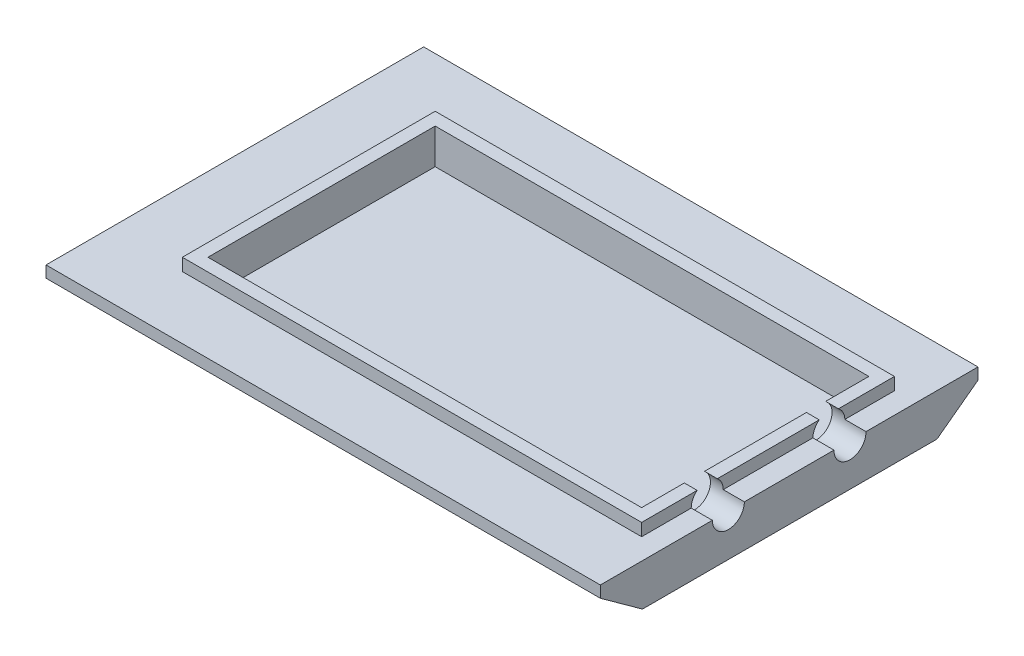
ISO-10303-21;
HEADER;
FILE_DESCRIPTION(('STEP AP214'),'2;1');
FILE_NAME('part.step','',(''),(''),'','','');
FILE_SCHEMA(('AUTOMOTIVE_DESIGN { 1 0 10303 214 1 1 1 1 }'));
ENDSEC;
DATA;
#1=APPLICATION_CONTEXT('core data for automotive mechanical design processes');
#2=APPLICATION_PROTOCOL_DEFINITION('international standard','automotive_design',2000,#1);
#3=PRODUCT_CONTEXT('',#1,'mechanical');
#4=PRODUCT('Part','Part','',(#3));
#5=PRODUCT_RELATED_PRODUCT_CATEGORY('part','',(#4));
#6=PRODUCT_DEFINITION_FORMATION('','',#4);
#7=PRODUCT_DEFINITION_CONTEXT('part definition',#1,'design');
#8=PRODUCT_DEFINITION('design','',#6,#7);
#9=PRODUCT_DEFINITION_SHAPE('','',#8);
#10=(LENGTH_UNIT() NAMED_UNIT(*) SI_UNIT(.MILLI.,.METRE.));
#11=(NAMED_UNIT(*) PLANE_ANGLE_UNIT() SI_UNIT($,.RADIAN.));
#12=(NAMED_UNIT(*) SI_UNIT($,.STERADIAN.) SOLID_ANGLE_UNIT());
#13=UNCERTAINTY_MEASURE_WITH_UNIT(LENGTH_MEASURE(1.E-05),#10,'distance_accuracy_value','');
#14=(GEOMETRIC_REPRESENTATION_CONTEXT(3) GLOBAL_UNCERTAINTY_ASSIGNED_CONTEXT((#13)) GLOBAL_UNIT_ASSIGNED_CONTEXT((#10,
#11,#12)) REPRESENTATION_CONTEXT('',''));
#15=CARTESIAN_POINT('',(0.,0.,0.));
#16=DIRECTION('',(0.,0.,1.));
#17=DIRECTION('',(1.,0.,0.));
#18=AXIS2_PLACEMENT_3D('',#15,#16,#17);
#19=CARTESIAN_POINT('',(0.,21.59,0.));
#20=DIRECTION('',(0.,1.,0.));
#21=DIRECTION('',(0.,0.,1.));
#22=AXIS2_PLACEMENT_3D('',#19,#20,#21);
#23=PLANE('',#22);
#24=DIRECTION('',(1.,0.,0.));
#25=VECTOR('',#24,1.);
#26=CARTESIAN_POINT('',(-19.05,21.59,86.7760235248049));
#27=LINE('',#26,#25);
#28=CARTESIAN_POINT('',(-13.462,21.59,86.7760235248049));
#29=VERTEX_POINT('',#28);
#30=CARTESIAN_POINT('',(-8.382,21.59,86.7760235248049));
#31=VERTEX_POINT('',#30);
#32=EDGE_CURVE('E480',#29,#31,#27,.T.);
#33=ORIENTED_EDGE('',*,*,#32,.F.);
#34=DIRECTION('',(0.,0.,-1.));
#35=VECTOR('',#34,1.);
#36=CARTESIAN_POINT('',(-13.462,21.59,13.5558695652174));
#37=LINE('',#36,#35);
#38=CARTESIAN_POINT('',(-13.462,21.59,103.725869565217));
#39=VERTEX_POINT('',#38);
#40=EDGE_CURVE('E483',#39,#29,#37,.T.);
#41=ORIENTED_EDGE('',*,*,#40,.F.);
#42=DIRECTION('',(1.,0.,0.));
#43=VECTOR('',#42,1.);
#44=CARTESIAN_POINT('',(-185.547,21.59,103.725869565217));
#45=LINE('',#44,#43);
#46=CARTESIAN_POINT('',(-185.547,21.59,103.725869565217));
#47=VERTEX_POINT('',#46);
#48=EDGE_CURVE('E505',#47,#39,#45,.T.);
#49=ORIENTED_EDGE('',*,*,#48,.F.);
#50=DIRECTION('',(0.,0.,1.));
#51=VECTOR('',#50,1.);
#52=CARTESIAN_POINT('',(-185.547,21.59,13.5558695652174));
#53=LINE('',#52,#51);
#54=CARTESIAN_POINT('',(-185.547,21.59,13.5558695652174));
#55=VERTEX_POINT('',#54);
#56=EDGE_CURVE('E509',#55,#47,#53,.T.);
#57=ORIENTED_EDGE('',*,*,#56,.F.);
#58=DIRECTION('',(-1.,0.,0.));
#59=VECTOR('',#58,1.);
#60=CARTESIAN_POINT('',(-185.547,21.59,13.5558695652174));
#61=LINE('',#60,#59);
#62=CARTESIAN_POINT('',(-13.462,21.59,13.5558695652174));
#63=VERTEX_POINT('',#62);
#64=EDGE_CURVE('E512',#63,#55,#61,.T.);
#65=ORIENTED_EDGE('',*,*,#64,.F.);
#66=CARTESIAN_POINT('',(-13.462,21.59,30.7008695652174));
#67=VERTEX_POINT('',#66);
#68=EDGE_CURVE('E499',#67,#63,#37,.T.);
#69=ORIENTED_EDGE('',*,*,#68,.F.);
#70=DIRECTION('',(1.,0.,0.));
#71=VECTOR('',#70,1.);
#72=CARTESIAN_POINT('',(-19.05,21.59,30.7008695652174));
#73=LINE('',#72,#71);
#74=CARTESIAN_POINT('',(-8.382,21.59,30.7008695652174));
#75=VERTEX_POINT('',#74);
#76=EDGE_CURVE('E70',#75,#67,#73,.F.);
#77=ORIENTED_EDGE('',*,*,#76,.F.);
#78=DIRECTION('',(0.,0.,-1.));
#79=VECTOR('',#78,1.);
#80=CARTESIAN_POINT('',(-8.382,21.59,8.47586956521745));
#81=LINE('',#80,#79);
#82=CARTESIAN_POINT('',(-8.382,21.59,8.47586956521745));
#83=VERTEX_POINT('',#82);
#84=EDGE_CURVE('E585',#75,#83,#81,.T.);
#85=ORIENTED_EDGE('',*,*,#84,.T.);
#86=DIRECTION('',(-1.,0.,0.));
#87=VECTOR('',#86,1.);
#88=CARTESIAN_POINT('',(-190.627,21.59,8.47586956521744));
#89=LINE('',#88,#87);
#90=CARTESIAN_POINT('',(-190.627,21.59,8.47586956521744));
#91=VERTEX_POINT('',#90);
#92=EDGE_CURVE('E589',#83,#91,#89,.T.);
#93=ORIENTED_EDGE('',*,*,#92,.T.);
#94=DIRECTION('',(0.,0.,1.));
#95=VECTOR('',#94,1.);
#96=CARTESIAN_POINT('',(-190.627,21.59,8.47586956521744));
#97=LINE('',#96,#95);
#98=CARTESIAN_POINT('',(-190.627,21.59,108.805869565217));
#99=VERTEX_POINT('',#98);
#100=EDGE_CURVE('E681',#91,#99,#97,.T.);
#101=ORIENTED_EDGE('',*,*,#100,.T.);
#102=DIRECTION('',(1.,0.,0.));
#103=VECTOR('',#102,1.);
#104=CARTESIAN_POINT('',(-190.627,21.59,108.805869565217));
#105=LINE('',#104,#103);
#106=CARTESIAN_POINT('',(-8.382,21.59,108.805869565217));
#107=VERTEX_POINT('',#106);
#108=EDGE_CURVE('E590',#99,#107,#105,.T.);
#109=ORIENTED_EDGE('',*,*,#108,.T.);
#110=EDGE_CURVE('E485',#107,#31,#81,.T.);
#111=ORIENTED_EDGE('',*,*,#110,.T.);
#112=EDGE_LOOP('',(#33,#41,#49,#57,#65,#69,#77,#85,#93,#101,#109,#111));
#113=FACE_BOUND('',#112,.T.);
#114=ADVANCED_FACE('F53',(#113),#23,.T.);
#115=CARTESIAN_POINT('',(0.,16.6624,0.));
#116=DIRECTION('',(0.,1.,0.));
#117=DIRECTION('',(0.,0.,1.));
#118=AXIS2_PLACEMENT_3D('',#115,#116,#117);
#119=PLANE('',#118);
#120=DIRECTION('',(1.,0.,0.));
#121=VECTOR('',#120,1.);
#122=CARTESIAN_POINT('',(-19.05,16.6624,89.1208695652174));
#123=LINE('',#122,#121);
#124=CARTESIAN_POINT('',(-8.382,16.6624,89.1208695652174));
#125=VERTEX_POINT('',#124);
#126=CARTESIAN_POINT('',(0.,16.6624,89.1208695652174));
#127=VERTEX_POINT('',#126);
#128=EDGE_CURVE('E533',#125,#127,#123,.T.);
#129=ORIENTED_EDGE('',*,*,#128,.F.);
#130=DIRECTION('',(0.,0.,1.));
#131=VECTOR('',#130,1.);
#132=CARTESIAN_POINT('',(-8.382,16.6624,0.));
#133=LINE('',#132,#131);
#134=CARTESIAN_POINT('',(-8.382,16.6624,108.805869565217));
#135=VERTEX_POINT('',#134);
#136=EDGE_CURVE('E564',#125,#135,#133,.T.);
#137=ORIENTED_EDGE('',*,*,#136,.T.);
#138=DIRECTION('',(-1.,0.,0.));
#139=VECTOR('',#138,1.);
#140=CARTESIAN_POINT('',(0.,16.6624,108.805869565217));
#141=LINE('',#140,#139);
#142=CARTESIAN_POINT('',(-190.627,16.6624,108.805869565217));
#143=VERTEX_POINT('',#142);
#144=EDGE_CURVE('E568',#135,#143,#141,.T.);
#145=ORIENTED_EDGE('',*,*,#144,.T.);
#146=DIRECTION('',(0.,0.,-1.));
#147=VECTOR('',#146,1.);
#148=CARTESIAN_POINT('',(-190.627,16.6624,0.));
#149=LINE('',#148,#147);
#150=CARTESIAN_POINT('',(-190.627,16.6624,8.47586956521744));
#151=VERTEX_POINT('',#150);
#152=EDGE_CURVE('E576',#143,#151,#149,.T.);
#153=ORIENTED_EDGE('',*,*,#152,.T.);
#154=DIRECTION('',(1.,0.,0.));
#155=VECTOR('',#154,1.);
#156=CARTESIAN_POINT('',(0.,16.6624,8.47586956521745));
#157=LINE('',#156,#155);
#158=CARTESIAN_POINT('',(-8.382,16.6624,8.47586956521745));
#159=VERTEX_POINT('',#158);
#160=EDGE_CURVE('E569',#151,#159,#157,.T.);
#161=ORIENTED_EDGE('',*,*,#160,.T.);
#162=CARTESIAN_POINT('',(-8.382,16.6624,28.1626986286405));
#163=VERTEX_POINT('',#162);
#164=EDGE_CURVE('E223',#159,#163,#133,.T.);
#165=ORIENTED_EDGE('',*,*,#164,.T.);
#166=DIRECTION('',(1.,0.,0.));
#167=VECTOR('',#166,1.);
#168=CARTESIAN_POINT('',(-19.05,16.6624,28.1626986286405));
#169=LINE('',#168,#167);
#170=CARTESIAN_POINT('',(0.,16.6624,28.1626986286405));
#171=VERTEX_POINT('',#170);
#172=EDGE_CURVE('E204',#171,#163,#169,.F.);
#173=ORIENTED_EDGE('',*,*,#172,.F.);
#174=DIRECTION('',(0.,0.,-1.));
#175=VECTOR('',#174,1.);
#176=CARTESIAN_POINT('',(0.,16.6624,-16.2891304347826));
#177=LINE('',#176,#175);
#178=CARTESIAN_POINT('',(0.,16.6624,-16.2891304347826));
#179=VERTEX_POINT('',#178);
#180=EDGE_CURVE('E219',#171,#179,#177,.T.);
#181=ORIENTED_EDGE('',*,*,#180,.T.);
#182=DIRECTION('',(-1.,0.,0.));
#183=VECTOR('',#182,1.);
#184=CARTESIAN_POINT('',(-219.964,16.6624,-16.2891304347826));
#185=LINE('',#184,#183);
#186=CARTESIAN_POINT('',(-219.964,16.6624,-16.2891304347826));
#187=VERTEX_POINT('',#186);
#188=EDGE_CURVE('E243',#179,#187,#185,.T.);
#189=ORIENTED_EDGE('',*,*,#188,.T.);
#190=DIRECTION('',(0.,0.,1.));
#191=VECTOR('',#190,1.);
#192=CARTESIAN_POINT('',(-219.964,16.6624,-16.2891304347826));
#193=LINE('',#192,#191);
#194=CARTESIAN_POINT('',(-219.964,16.6624,133.570869565217));
#195=VERTEX_POINT('',#194);
#196=EDGE_CURVE('E238',#187,#195,#193,.T.);
#197=ORIENTED_EDGE('',*,*,#196,.T.);
#198=DIRECTION('',(1.,0.,0.));
#199=VECTOR('',#198,1.);
#200=CARTESIAN_POINT('',(-219.964,16.6624,133.570869565217));
#201=LINE('',#200,#199);
#202=CARTESIAN_POINT('',(0.,16.6624,133.570869565217));
#203=VERTEX_POINT('',#202);
#204=EDGE_CURVE('E233',#195,#203,#201,.T.);
#205=ORIENTED_EDGE('',*,*,#204,.T.);
#206=EDGE_CURVE('E235',#203,#127,#177,.T.);
#207=ORIENTED_EDGE('',*,*,#206,.T.);
#208=EDGE_LOOP('',(#129,#137,#145,#153,#161,#165,#173,#181,#189,#197,#205,#207));
#209=FACE_BOUND('',#208,.T.);
#210=ADVANCED_FACE('F218',(#209),#119,.T.);
#211=CARTESIAN_POINT('',(-8.382,21.59,8.47586956521745));
#212=DIRECTION('',(-1.,0.,0.));
#213=DIRECTION('',(0.,0.,1.));
#214=AXIS2_PLACEMENT_3D('',#211,#212,#213);
#215=PLANE('',#214);
#216=ORIENTED_EDGE('',*,*,#136,.F.);
#217=CARTESIAN_POINT('',(-8.382,16.6624,82.7708695652174));
#218=DIRECTION('',(-1.,0.,0.));
#219=DIRECTION('',(0.,0.,1.));
#220=AXIS2_PLACEMENT_3D('',#217,#218,#219);
#221=CIRCLE('',#220,6.35);
#222=EDGE_CURVE('E539',#125,#31,#221,.T.);
#223=ORIENTED_EDGE('',*,*,#222,.T.);
#224=ORIENTED_EDGE('',*,*,#110,.F.);
#225=DIRECTION('',(0.,-1.,0.));
#226=VECTOR('',#225,1.);
#227=CARTESIAN_POINT('',(-8.382,21.59,108.805869565217));
#228=LINE('',#227,#226);
#229=EDGE_CURVE('E603',#107,#135,#228,.T.);
#230=ORIENTED_EDGE('',*,*,#229,.T.);
#231=EDGE_LOOP('',(#216,#223,#224,#230));
#232=FACE_BOUND('',#231,.T.);
#233=ADVANCED_FACE('F438',(#232),#215,.F.);
#234=CARTESIAN_POINT('',(-8.382,21.59,78.7657156056298));
#235=VERTEX_POINT('',#234);
#236=CARTESIAN_POINT('',(-8.382,21.59,38.3208695652174));
#237=VERTEX_POINT('',#236);
#238=EDGE_CURVE('E583',#235,#237,#81,.T.);
#239=ORIENTED_EDGE('',*,*,#238,.F.);
#240=CARTESIAN_POINT('',(-8.382,16.6624,76.4208695652174));
#241=VERTEX_POINT('',#240);
#242=EDGE_CURVE('E488',#235,#241,#221,.T.);
#243=ORIENTED_EDGE('',*,*,#242,.T.);
#244=CARTESIAN_POINT('',(-8.382,16.6624,40.8590405017944));
#245=VERTEX_POINT('',#244);
#246=EDGE_CURVE('E560',#245,#241,#133,.T.);
#247=ORIENTED_EDGE('',*,*,#246,.F.);
#248=CARTESIAN_POINT('',(-8.382,16.51,34.5108695652174));
#249=DIRECTION('',(-1.,0.,0.));
#250=DIRECTION('',(0.,0.,1.));
#251=AXIS2_PLACEMENT_3D('',#248,#249,#250);
#252=CIRCLE('',#251,6.35);
#253=EDGE_CURVE('E225',#245,#237,#252,.T.);
#254=ORIENTED_EDGE('',*,*,#253,.T.);
#255=EDGE_LOOP('',(#239,#243,#247,#254));
#256=FACE_BOUND('',#255,.T.);
#257=ADVANCED_FACE('F439',(#256),#215,.F.);
#258=DIRECTION('',(1.,0.,0.));
#259=VECTOR('',#258,1.);
#260=CARTESIAN_POINT('',(-19.05,21.59,78.7657156056298));
#261=LINE('',#260,#259);
#262=CARTESIAN_POINT('',(-13.462,21.59,78.7657156056298));
#263=VERTEX_POINT('',#262);
#264=EDGE_CURVE('E77',#235,#263,#261,.F.);
#265=ORIENTED_EDGE('',*,*,#264,.F.);
#266=ORIENTED_EDGE('',*,*,#238,.T.);
#267=DIRECTION('',(1.,0.,0.));
#268=VECTOR('',#267,1.);
#269=CARTESIAN_POINT('',(-19.05,21.59,38.3208695652174));
#270=LINE('',#269,#268);
#271=CARTESIAN_POINT('',(-13.462,21.59,38.3208695652174));
#272=VERTEX_POINT('',#271);
#273=EDGE_CURVE('E550',#272,#237,#270,.T.);
#274=ORIENTED_EDGE('',*,*,#273,.F.);
#275=EDGE_CURVE('E497',#263,#272,#37,.T.);
#276=ORIENTED_EDGE('',*,*,#275,.F.);
#277=EDGE_LOOP('',(#265,#266,#274,#276));
#278=FACE_BOUND('',#277,.T.);
#279=ADVANCED_FACE('F424',(#278),#23,.T.);
#280=DIRECTION('',(1.,0.,0.));
#281=VECTOR('',#280,1.);
#282=CARTESIAN_POINT('',(-19.05,16.6624,76.4208695652174));
#283=LINE('',#282,#281);
#284=CARTESIAN_POINT('',(0.,16.6624,76.4208695652174));
#285=VERTEX_POINT('',#284);
#286=EDGE_CURVE('E536',#285,#241,#283,.F.);
#287=ORIENTED_EDGE('',*,*,#286,.F.);
#288=CARTESIAN_POINT('',(0.,16.6624,40.8590405017944));
#289=VERTEX_POINT('',#288);
#290=EDGE_CURVE('E232',#285,#289,#177,.T.);
#291=ORIENTED_EDGE('',*,*,#290,.T.);
#292=DIRECTION('',(1.,0.,0.));
#293=VECTOR('',#292,1.);
#294=CARTESIAN_POINT('',(-19.05,16.6624,40.8590405017944));
#295=LINE('',#294,#293);
#296=EDGE_CURVE('E207',#245,#289,#295,.T.);
#297=ORIENTED_EDGE('',*,*,#296,.F.);
#298=ORIENTED_EDGE('',*,*,#246,.T.);
#299=EDGE_LOOP('',(#287,#291,#297,#298));
#300=FACE_BOUND('',#299,.T.);
#301=ADVANCED_FACE('F421',(#300),#119,.T.);
#302=CARTESIAN_POINT('',(0.,0.,0.));
#303=DIRECTION('',(0.,1.,0.));
#304=DIRECTION('',(0.,0.,1.));
#305=AXIS2_PLACEMENT_3D('',#302,#303,#304);
#306=PLANE('',#305);
#307=DIRECTION('',(0.,0.,1.));
#308=VECTOR('',#307,1.);
#309=CARTESIAN_POINT('',(-190.5,0.,0.));
#310=LINE('',#309,#308);
#311=CARTESIAN_POINT('',(-190.5,0.,0.));
#312=VERTEX_POINT('',#311);
#313=CARTESIAN_POINT('',(-190.5,0.,116.84));
#314=VERTEX_POINT('',#313);
#315=EDGE_CURVE('E321',#312,#314,#310,.T.);
#316=ORIENTED_EDGE('',*,*,#315,.F.);
#317=DIRECTION('',(-1.,0.,0.));
#318=VECTOR('',#317,1.);
#319=CARTESIAN_POINT('',(-190.5,0.,0.));
#320=LINE('',#319,#318);
#321=CARTESIAN_POINT('',(0.,0.,0.));
#322=VERTEX_POINT('',#321);
#323=EDGE_CURVE('E635',#322,#312,#320,.T.);
#324=ORIENTED_EDGE('',*,*,#323,.F.);
#325=DIRECTION('',(0.,0.,-1.));
#326=VECTOR('',#325,1.);
#327=CARTESIAN_POINT('',(0.,0.,0.));
#328=LINE('',#327,#326);
#329=CARTESIAN_POINT('',(0.,0.,116.84));
#330=VERTEX_POINT('',#329);
#331=EDGE_CURVE('E294',#330,#322,#328,.T.);
#332=ORIENTED_EDGE('',*,*,#331,.F.);
#333=DIRECTION('',(1.,0.,0.));
#334=VECTOR('',#333,1.);
#335=CARTESIAN_POINT('',(-190.5,0.,116.84));
#336=LINE('',#335,#334);
#337=EDGE_CURVE('E307',#314,#330,#336,.T.);
#338=ORIENTED_EDGE('',*,*,#337,.F.);
#339=EDGE_LOOP('',(#316,#324,#332,#338));
#340=FACE_BOUND('',#339,.T.);
#341=ADVANCED_FACE('F55',(#340),#306,.F.);
#342=CARTESIAN_POINT('',(-27.4541323617712,-66.9050284446525,0.));
#343=DIRECTION('',(-0.379626369443367,-0.92513989192081,0.));
#344=DIRECTION('',(0.92513989192081,-0.379626369443367,0.));
#345=AXIS2_PLACEMENT_3D('',#342,#343,#344);
#346=PLANE('',#345);
#347=DIRECTION('',(0.823659401549222,-0.337984375118474,0.455358927018403));
#348=VECTOR('',#347,1.);
#349=CARTESIAN_POINT('',(-219.964,12.0904,-16.2891304347826));
#350=LINE('',#349,#348);
#351=CARTESIAN_POINT('',(-219.964,12.0904,-16.2891304347826));
#352=VERTEX_POINT('',#351);
#353=EDGE_CURVE('E357',#352,#312,#350,.T.);
#354=ORIENTED_EDGE('',*,*,#353,.T.);
#355=ORIENTED_EDGE('',*,*,#315,.T.);
#356=DIRECTION('',(0.819004837822664,-0.33607439896861,-0.465064591192406));
#357=VECTOR('',#356,1.);
#358=CARTESIAN_POINT('',(-219.964,12.0904,133.570869565217));
#359=LINE('',#358,#357);
#360=CARTESIAN_POINT('',(-219.964,12.0904,133.570869565217));
#361=VERTEX_POINT('',#360);
#362=EDGE_CURVE('E354',#361,#314,#359,.T.);
#363=ORIENTED_EDGE('',*,*,#362,.F.);
#364=DIRECTION('',(0.,0.,1.));
#365=VECTOR('',#364,1.);
#366=CARTESIAN_POINT('',(-219.964,12.0904,-16.2891304347826));
#367=LINE('',#366,#365);
#368=EDGE_CURVE('E351',#352,#361,#367,.T.);
#369=ORIENTED_EDGE('',*,*,#368,.F.);
#370=EDGE_LOOP('',(#354,#355,#363,#369));
#371=FACE_BOUND('',#370,.T.);
#372=ADVANCED_FACE('F327',(#371),#346,.T.);
#373=CARTESIAN_POINT('',(0.,-55.4676073759251,40.0831264390513));
#374=DIRECTION('',(0.,0.810518373573741,-0.585713211477578));
#375=DIRECTION('',(0.,0.585713211477578,0.810518373573741));
#376=AXIS2_PLACEMENT_3D('',#373,#374,#375);
#377=PLANE('',#376);
#378=ORIENTED_EDGE('',*,*,#362,.T.);
#379=ORIENTED_EDGE('',*,*,#337,.T.);
#380=DIRECTION('',(0.,-0.585713211477578,-0.810518373573741));
#381=VECTOR('',#380,1.);
#382=CARTESIAN_POINT('',(0.,12.0904,133.570869565217));
#383=LINE('',#382,#381);
#384=CARTESIAN_POINT('',(0.,12.0904,133.570869565217));
#385=VERTEX_POINT('',#384);
#386=EDGE_CURVE('E371',#385,#330,#383,.T.);
#387=ORIENTED_EDGE('',*,*,#386,.F.);
#388=DIRECTION('',(1.,0.,0.));
#389=VECTOR('',#388,1.);
#390=CARTESIAN_POINT('',(-219.964,12.0904,133.570869565217));
#391=LINE('',#390,#389);
#392=EDGE_CURVE('E368',#361,#385,#391,.T.);
#393=ORIENTED_EDGE('',*,*,#392,.F.);
#394=EDGE_LOOP('',(#378,#379,#387,#393));
#395=FACE_BOUND('',#394,.T.);
#396=ADVANCED_FACE('F274',(#395),#377,.F.);
#397=CARTESIAN_POINT('',(0.,0.,0.));
#398=DIRECTION('',(0.,-0.802982046011134,-0.596003216252876));
#399=DIRECTION('',(0.,0.596003216252876,-0.802982046011134));
#400=AXIS2_PLACEMENT_3D('',#397,#398,#399);
#401=PLANE('',#400);
#402=DIRECTION('',(0.,-0.596003216252876,0.802982046011134));
#403=VECTOR('',#402,1.);
#404=CARTESIAN_POINT('',(0.,12.0904,-16.2891304347826));
#405=LINE('',#404,#403);
#406=CARTESIAN_POINT('',(0.,12.0904,-16.2891304347826));
#407=VERTEX_POINT('',#406);
#408=EDGE_CURVE('E263',#407,#322,#405,.T.);
#409=ORIENTED_EDGE('',*,*,#408,.T.);
#410=ORIENTED_EDGE('',*,*,#323,.T.);
#411=ORIENTED_EDGE('',*,*,#353,.F.);
#412=DIRECTION('',(-1.,0.,0.));
#413=VECTOR('',#412,1.);
#414=CARTESIAN_POINT('',(-219.964,12.0904,-16.2891304347826));
#415=LINE('',#414,#413);
#416=EDGE_CURVE('E258',#407,#352,#415,.T.);
#417=ORIENTED_EDGE('',*,*,#416,.F.);
#418=EDGE_LOOP('',(#409,#410,#411,#417));
#419=FACE_BOUND('',#418,.T.);
#420=ADVANCED_FACE('F265',(#419),#401,.T.);
#421=CARTESIAN_POINT('',(0.,0.,0.));
#422=DIRECTION('',(-1.,0.,0.));
#423=DIRECTION('',(0.,-1.,0.));
#424=AXIS2_PLACEMENT_3D('',#421,#422,#423);
#425=PLANE('',#424);
#426=ORIENTED_EDGE('',*,*,#290,.F.);
#427=CARTESIAN_POINT('',(0.,16.6624,82.7708695652174));
#428=DIRECTION('',(1.,0.,0.));
#429=DIRECTION('',(0.,0.,-1.));
#430=AXIS2_PLACEMENT_3D('',#427,#428,#429);
#431=CIRCLE('',#430,6.35);
#432=EDGE_CURVE('E213',#127,#285,#431,.T.);
#433=ORIENTED_EDGE('',*,*,#432,.F.);
#434=ORIENTED_EDGE('',*,*,#206,.F.);
#435=DIRECTION('',(0.,-1.,0.));
#436=VECTOR('',#435,1.);
#437=CARTESIAN_POINT('',(0.,16.6624,133.570869565217));
#438=LINE('',#437,#436);
#439=EDGE_CURVE('E391',#203,#385,#438,.T.);
#440=ORIENTED_EDGE('',*,*,#439,.T.);
#441=ORIENTED_EDGE('',*,*,#386,.T.);
#442=ORIENTED_EDGE('',*,*,#331,.T.);
#443=ORIENTED_EDGE('',*,*,#408,.F.);
#444=DIRECTION('',(0.,-1.,0.));
#445=VECTOR('',#444,1.);
#446=CARTESIAN_POINT('',(0.,16.6624,-16.2891304347826));
#447=LINE('',#446,#445);
#448=EDGE_CURVE('E229',#179,#407,#447,.T.);
#449=ORIENTED_EDGE('',*,*,#448,.F.);
#450=ORIENTED_EDGE('',*,*,#180,.F.);
#451=CARTESIAN_POINT('',(0.,16.51,34.5108695652174));
#452=DIRECTION('',(1.,0.,0.));
#453=DIRECTION('',(0.,0.,-1.));
#454=AXIS2_PLACEMENT_3D('',#451,#452,#453);
#455=CIRCLE('',#454,6.35);
#456=EDGE_CURVE('E201',#289,#171,#455,.T.);
#457=ORIENTED_EDGE('',*,*,#456,.F.);
#458=EDGE_LOOP('',(#426,#433,#434,#440,#441,#442,#443,#449,#450,#457));
#459=FACE_BOUND('',#458,.T.);
#460=ADVANCED_FACE('F227',(#459),#425,.F.);
#461=CARTESIAN_POINT('',(-219.964,16.6624,-16.2891304347826));
#462=DIRECTION('',(1.,0.,0.));
#463=DIRECTION('',(0.,0.,-1.));
#464=AXIS2_PLACEMENT_3D('',#461,#462,#463);
#465=PLANE('',#464);
#466=ORIENTED_EDGE('',*,*,#368,.T.);
#467=DIRECTION('',(0.,-1.,0.));
#468=VECTOR('',#467,1.);
#469=CARTESIAN_POINT('',(-219.964,16.6624,133.570869565217));
#470=LINE('',#469,#468);
#471=EDGE_CURVE('E397',#195,#361,#470,.T.);
#472=ORIENTED_EDGE('',*,*,#471,.F.);
#473=ORIENTED_EDGE('',*,*,#196,.F.);
#474=DIRECTION('',(0.,-1.,0.));
#475=VECTOR('',#474,1.);
#476=CARTESIAN_POINT('',(-219.964,16.6624,-16.2891304347826));
#477=LINE('',#476,#475);
#478=EDGE_CURVE('E246',#187,#352,#477,.T.);
#479=ORIENTED_EDGE('',*,*,#478,.T.);
#480=EDGE_LOOP('',(#466,#472,#473,#479));
#481=FACE_BOUND('',#480,.T.);
#482=ADVANCED_FACE('F336',(#481),#465,.F.);
#483=CARTESIAN_POINT('',(-219.964,16.6624,133.570869565217));
#484=DIRECTION('',(0.,0.,-1.));
#485=DIRECTION('',(-1.,0.,0.));
#486=AXIS2_PLACEMENT_3D('',#483,#484,#485);
#487=PLANE('',#486);
#488=ORIENTED_EDGE('',*,*,#392,.T.);
#489=ORIENTED_EDGE('',*,*,#439,.F.);
#490=ORIENTED_EDGE('',*,*,#204,.F.);
#491=ORIENTED_EDGE('',*,*,#471,.T.);
#492=EDGE_LOOP('',(#488,#489,#490,#491));
#493=FACE_BOUND('',#492,.T.);
#494=ADVANCED_FACE('F408',(#493),#487,.F.);
#495=CARTESIAN_POINT('',(-219.964,16.6624,-16.2891304347826));
#496=DIRECTION('',(0.,0.,1.));
#497=DIRECTION('',(1.,0.,0.));
#498=AXIS2_PLACEMENT_3D('',#495,#496,#497);
#499=PLANE('',#498);
#500=ORIENTED_EDGE('',*,*,#416,.T.);
#501=ORIENTED_EDGE('',*,*,#478,.F.);
#502=ORIENTED_EDGE('',*,*,#188,.F.);
#503=ORIENTED_EDGE('',*,*,#448,.T.);
#504=EDGE_LOOP('',(#500,#501,#502,#503));
#505=FACE_BOUND('',#504,.T.);
#506=ADVANCED_FACE('F416',(#505),#499,.F.);
#507=CARTESIAN_POINT('',(-190.627,21.59,8.47586956521744));
#508=DIRECTION('',(1.,0.,0.));
#509=DIRECTION('',(0.,0.,-1.));
#510=AXIS2_PLACEMENT_3D('',#507,#508,#509);
#511=PLANE('',#510);
#512=ORIENTED_EDGE('',*,*,#152,.F.);
#513=DIRECTION('',(0.,-1.,0.));
#514=VECTOR('',#513,1.);
#515=CARTESIAN_POINT('',(-190.627,21.59,108.805869565217));
#516=LINE('',#515,#514);
#517=EDGE_CURVE('E607',#99,#143,#516,.T.);
#518=ORIENTED_EDGE('',*,*,#517,.F.);
#519=ORIENTED_EDGE('',*,*,#100,.F.);
#520=DIRECTION('',(0.,-1.,0.));
#521=VECTOR('',#520,1.);
#522=CARTESIAN_POINT('',(-190.627,21.59,8.47586956521744));
#523=LINE('',#522,#521);
#524=EDGE_CURVE('E596',#91,#151,#523,.T.);
#525=ORIENTED_EDGE('',*,*,#524,.T.);
#526=EDGE_LOOP('',(#512,#518,#519,#525));
#527=FACE_BOUND('',#526,.T.);
#528=ADVANCED_FACE('F420',(#527),#511,.F.);
#529=CARTESIAN_POINT('',(-190.627,21.59,108.805869565217));
#530=DIRECTION('',(0.,0.,-1.));
#531=DIRECTION('',(-1.,0.,0.));
#532=AXIS2_PLACEMENT_3D('',#529,#530,#531);
#533=PLANE('',#532);
#534=ORIENTED_EDGE('',*,*,#144,.F.);
#535=ORIENTED_EDGE('',*,*,#229,.F.);
#536=ORIENTED_EDGE('',*,*,#108,.F.);
#537=ORIENTED_EDGE('',*,*,#517,.T.);
#538=EDGE_LOOP('',(#534,#535,#536,#537));
#539=FACE_BOUND('',#538,.T.);
#540=ADVANCED_FACE('F428',(#539),#533,.F.);
#541=ORIENTED_EDGE('',*,*,#84,.F.);
#542=EDGE_CURVE('E547',#75,#163,#252,.T.);
#543=ORIENTED_EDGE('',*,*,#542,.T.);
#544=ORIENTED_EDGE('',*,*,#164,.F.);
#545=DIRECTION('',(0.,-1.,0.));
#546=VECTOR('',#545,1.);
#547=CARTESIAN_POINT('',(-8.382,21.59,8.47586956521745));
#548=LINE('',#547,#546);
#549=EDGE_CURVE('E600',#83,#159,#548,.T.);
#550=ORIENTED_EDGE('',*,*,#549,.F.);
#551=EDGE_LOOP('',(#541,#543,#544,#550));
#552=FACE_BOUND('',#551,.T.);
#553=ADVANCED_FACE('F432',(#552),#215,.F.);
#554=CARTESIAN_POINT('',(-190.627,21.59,8.47586956521744));
#555=DIRECTION('',(0.,0.,1.));
#556=DIRECTION('',(1.,0.,0.));
#557=AXIS2_PLACEMENT_3D('',#554,#555,#556);
#558=PLANE('',#557);
#559=ORIENTED_EDGE('',*,*,#160,.F.);
#560=ORIENTED_EDGE('',*,*,#524,.F.);
#561=ORIENTED_EDGE('',*,*,#92,.F.);
#562=ORIENTED_EDGE('',*,*,#549,.T.);
#563=EDGE_LOOP('',(#559,#560,#561,#562));
#564=FACE_BOUND('',#563,.T.);
#565=ADVANCED_FACE('F436',(#564),#558,.F.);
#566=CARTESIAN_POINT('',(-185.547,21.59,13.5558695652174));
#567=DIRECTION('',(0.,0.,1.));
#568=DIRECTION('',(1.,0.,0.));
#569=AXIS2_PLACEMENT_3D('',#566,#567,#568);
#570=PLANE('',#569);
#571=DIRECTION('',(0.,-1.,0.));
#572=VECTOR('',#571,1.);
#573=CARTESIAN_POINT('',(-185.547,21.59,13.5558695652174));
#574=LINE('',#573,#572);
#575=CARTESIAN_POINT('',(-185.547,7.62,13.5558695652174));
#576=VERTEX_POINT('',#575);
#577=EDGE_CURVE('E683',#55,#576,#574,.T.);
#578=ORIENTED_EDGE('',*,*,#577,.T.);
#579=DIRECTION('',(-1.,0.,0.));
#580=VECTOR('',#579,1.);
#581=CARTESIAN_POINT('',(-185.547,7.62,13.5558695652174));
#582=LINE('',#581,#580);
#583=CARTESIAN_POINT('',(-13.462,7.62,13.5558695652174));
#584=VERTEX_POINT('',#583);
#585=EDGE_CURVE('E529',#584,#576,#582,.T.);
#586=ORIENTED_EDGE('',*,*,#585,.F.);
#587=DIRECTION('',(0.,-1.,0.));
#588=VECTOR('',#587,1.);
#589=CARTESIAN_POINT('',(-13.462,21.59,13.5558695652174));
#590=LINE('',#589,#588);
#591=EDGE_CURVE('E496',#63,#584,#590,.T.);
#592=ORIENTED_EDGE('',*,*,#591,.F.);
#593=ORIENTED_EDGE('',*,*,#64,.T.);
#594=EDGE_LOOP('',(#578,#586,#592,#593));
#595=FACE_BOUND('',#594,.T.);
#596=ADVANCED_FACE('F442',(#595),#570,.T.);
#597=CARTESIAN_POINT('',(-185.547,21.59,13.5558695652174));
#598=DIRECTION('',(1.,0.,0.));
#599=DIRECTION('',(0.,0.,-1.));
#600=AXIS2_PLACEMENT_3D('',#597,#598,#599);
#601=PLANE('',#600);
#602=DIRECTION('',(0.,-1.,0.));
#603=VECTOR('',#602,1.);
#604=CARTESIAN_POINT('',(-185.547,21.59,103.725869565217));
#605=LINE('',#604,#603);
#606=CARTESIAN_POINT('',(-185.547,7.62,103.725869565217));
#607=VERTEX_POINT('',#606);
#608=EDGE_CURVE('E686',#47,#607,#605,.T.);
#609=ORIENTED_EDGE('',*,*,#608,.T.);
#610=DIRECTION('',(0.,0.,1.));
#611=VECTOR('',#610,1.);
#612=CARTESIAN_POINT('',(-185.547,7.62,13.5558695652174));
#613=LINE('',#612,#611);
#614=EDGE_CURVE('E525',#576,#607,#613,.T.);
#615=ORIENTED_EDGE('',*,*,#614,.F.);
#616=ORIENTED_EDGE('',*,*,#577,.F.);
#617=ORIENTED_EDGE('',*,*,#56,.T.);
#618=EDGE_LOOP('',(#609,#615,#616,#617));
#619=FACE_BOUND('',#618,.T.);
#620=ADVANCED_FACE('F449',(#619),#601,.T.);
#621=CARTESIAN_POINT('',(-185.547,21.59,103.725869565217));
#622=DIRECTION('',(0.,0.,-1.));
#623=DIRECTION('',(-1.,0.,0.));
#624=AXIS2_PLACEMENT_3D('',#621,#622,#623);
#625=PLANE('',#624);
#626=DIRECTION('',(0.,-1.,0.));
#627=VECTOR('',#626,1.);
#628=CARTESIAN_POINT('',(-13.462,21.59,103.725869565217));
#629=LINE('',#628,#627);
#630=CARTESIAN_POINT('',(-13.462,7.62,103.725869565217));
#631=VERTEX_POINT('',#630);
#632=EDGE_CURVE('E493',#39,#631,#629,.T.);
#633=ORIENTED_EDGE('',*,*,#632,.T.);
#634=DIRECTION('',(1.,0.,0.));
#635=VECTOR('',#634,1.);
#636=CARTESIAN_POINT('',(-185.547,7.62,103.725869565217));
#637=LINE('',#636,#635);
#638=EDGE_CURVE('E521',#607,#631,#637,.T.);
#639=ORIENTED_EDGE('',*,*,#638,.F.);
#640=ORIENTED_EDGE('',*,*,#608,.F.);
#641=ORIENTED_EDGE('',*,*,#48,.T.);
#642=EDGE_LOOP('',(#633,#639,#640,#641));
#643=FACE_BOUND('',#642,.T.);
#644=ADVANCED_FACE('F453',(#643),#625,.T.);
#645=CARTESIAN_POINT('',(-13.462,21.59,13.5558695652174));
#646=DIRECTION('',(-1.,0.,0.));
#647=DIRECTION('',(0.,0.,1.));
#648=AXIS2_PLACEMENT_3D('',#645,#646,#647);
#649=PLANE('',#648);
#650=CARTESIAN_POINT('',(-13.462,16.6624,82.7708695652174));
#651=DIRECTION('',(-1.,0.,0.));
#652=DIRECTION('',(0.,0.,1.));
#653=AXIS2_PLACEMENT_3D('',#650,#651,#652);
#654=CIRCLE('',#653,6.35);
#655=EDGE_CURVE('E12',#263,#29,#654,.T.);
#656=ORIENTED_EDGE('',*,*,#655,.F.);
#657=ORIENTED_EDGE('',*,*,#275,.T.);
#658=CARTESIAN_POINT('',(-13.462,16.51,34.5108695652174));
#659=DIRECTION('',(-1.,0.,0.));
#660=DIRECTION('',(0.,0.,1.));
#661=AXIS2_PLACEMENT_3D('',#658,#659,#660);
#662=CIRCLE('',#661,6.35);
#663=EDGE_CURVE('E63',#67,#272,#662,.T.);
#664=ORIENTED_EDGE('',*,*,#663,.F.);
#665=ORIENTED_EDGE('',*,*,#68,.T.);
#666=ORIENTED_EDGE('',*,*,#591,.T.);
#667=DIRECTION('',(0.,0.,-1.));
#668=VECTOR('',#667,1.);
#669=CARTESIAN_POINT('',(-13.462,7.62,13.5558695652174));
#670=LINE('',#669,#668);
#671=EDGE_CURVE('E517',#631,#584,#670,.T.);
#672=ORIENTED_EDGE('',*,*,#671,.F.);
#673=ORIENTED_EDGE('',*,*,#632,.F.);
#674=ORIENTED_EDGE('',*,*,#40,.T.);
#675=EDGE_LOOP('',(#656,#657,#664,#665,#666,#672,#673,#674));
#676=FACE_BOUND('',#675,.T.);
#677=ADVANCED_FACE('F457',(#676),#649,.T.);
#678=CARTESIAN_POINT('',(0.,7.62,0.));
#679=DIRECTION('',(0.,-1.,0.));
#680=DIRECTION('',(0.,0.,-1.));
#681=AXIS2_PLACEMENT_3D('',#678,#679,#680);
#682=PLANE('',#681);
#683=ORIENTED_EDGE('',*,*,#585,.T.);
#684=ORIENTED_EDGE('',*,*,#614,.T.);
#685=ORIENTED_EDGE('',*,*,#638,.T.);
#686=ORIENTED_EDGE('',*,*,#671,.T.);
#687=EDGE_LOOP('',(#683,#684,#685,#686));
#688=FACE_BOUND('',#687,.T.);
#689=ADVANCED_FACE('F461',(#688),#682,.F.);
#690=CARTESIAN_POINT('',(-19.05,16.51,34.5108695652174));
#691=DIRECTION('',(1.,0.,0.));
#692=DIRECTION('',(0.,0.,-1.));
#693=AXIS2_PLACEMENT_3D('',#690,#691,#692);
#694=CYLINDRICAL_SURFACE('',#693,6.35);
#695=ORIENTED_EDGE('',*,*,#296,.T.);
#696=ORIENTED_EDGE('',*,*,#456,.T.);
#697=ORIENTED_EDGE('',*,*,#172,.T.);
#698=ORIENTED_EDGE('',*,*,#542,.F.);
#699=ORIENTED_EDGE('',*,*,#76,.T.);
#700=ORIENTED_EDGE('',*,*,#663,.T.);
#701=ORIENTED_EDGE('',*,*,#273,.T.);
#702=ORIENTED_EDGE('',*,*,#253,.F.);
#703=EDGE_LOOP('',(#695,#696,#697,#698,#699,#700,#701,#702));
#704=FACE_BOUND('',#703,.T.);
#705=ADVANCED_FACE('F203',(#704),#694,.F.);
#706=CARTESIAN_POINT('',(-19.05,16.6624,82.7708695652174));
#707=DIRECTION('',(1.,0.,0.));
#708=DIRECTION('',(0.,0.,-1.));
#709=AXIS2_PLACEMENT_3D('',#706,#707,#708);
#710=CYLINDRICAL_SURFACE('',#709,6.35);
#711=ORIENTED_EDGE('',*,*,#128,.T.);
#712=ORIENTED_EDGE('',*,*,#432,.T.);
#713=ORIENTED_EDGE('',*,*,#286,.T.);
#714=ORIENTED_EDGE('',*,*,#242,.F.);
#715=ORIENTED_EDGE('',*,*,#264,.T.);
#716=ORIENTED_EDGE('',*,*,#655,.T.);
#717=ORIENTED_EDGE('',*,*,#32,.T.);
#718=ORIENTED_EDGE('',*,*,#222,.F.);
#719=EDGE_LOOP('',(#711,#712,#713,#714,#715,#716,#717,#718));
#720=FACE_BOUND('',#719,.T.);
#721=ADVANCED_FACE('F468',(#720),#710,.F.);
#722=CLOSED_SHELL('',(#114,#210,#233,#257,#279,#301,#341,#372,#396,#420,#460,#482,#494,#506,
#528,#540,#553,#565,#596,#620,#644,#677,#689,#705,#721));
#723=MANIFOLD_SOLID_BREP('B2',#722);
#724=ADVANCED_BREP_SHAPE_REPRESENTATION('',(#18,#723),#14);
#725=SHAPE_DEFINITION_REPRESENTATION(#9,#724);
ENDSEC;
END-ISO-10303-21;
